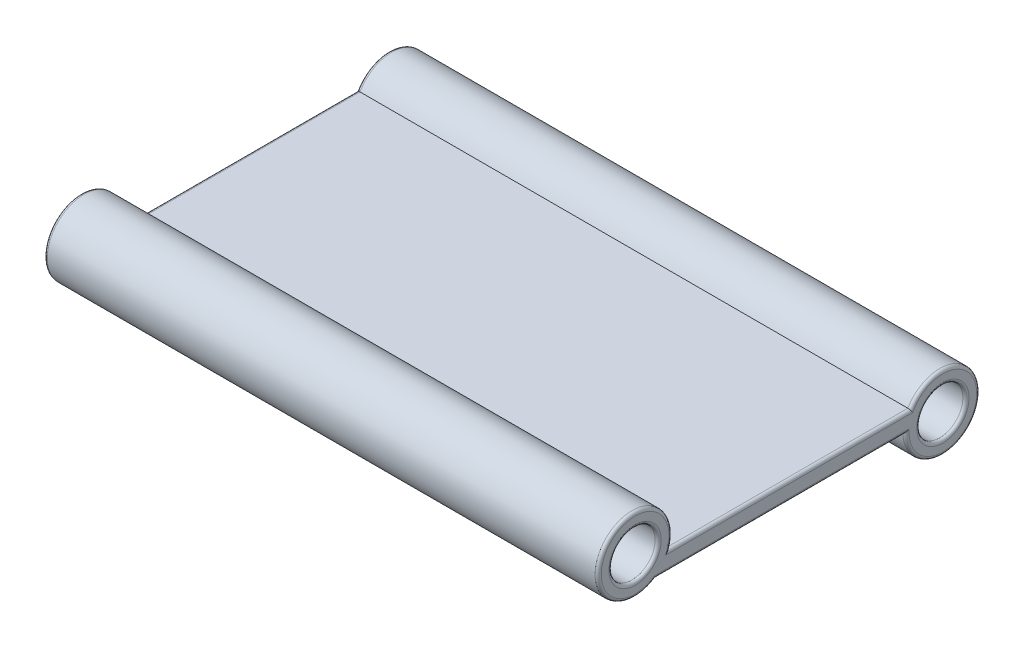
ISO-10303-21;
HEADER;
FILE_DESCRIPTION(('STEP AP214'),'2;1');
FILE_NAME('part.step','',(''),(''),'','','');
FILE_SCHEMA(('AUTOMOTIVE_DESIGN { 1 0 10303 214 1 1 1 1 }'));
ENDSEC;
DATA;
#1=APPLICATION_CONTEXT('core data for automotive mechanical design processes');
#2=APPLICATION_PROTOCOL_DEFINITION('international standard','automotive_design',2000,#1);
#3=PRODUCT_CONTEXT('',#1,'mechanical');
#4=PRODUCT('Part','Part','',(#3));
#5=PRODUCT_RELATED_PRODUCT_CATEGORY('part','',(#4));
#6=PRODUCT_DEFINITION_FORMATION('','',#4);
#7=PRODUCT_DEFINITION_CONTEXT('part definition',#1,'design');
#8=PRODUCT_DEFINITION('design','',#6,#7);
#9=PRODUCT_DEFINITION_SHAPE('','',#8);
#10=(LENGTH_UNIT() NAMED_UNIT(*) SI_UNIT(.MILLI.,.METRE.));
#11=(NAMED_UNIT(*) PLANE_ANGLE_UNIT() SI_UNIT($,.RADIAN.));
#12=(NAMED_UNIT(*) SI_UNIT($,.STERADIAN.) SOLID_ANGLE_UNIT());
#13=UNCERTAINTY_MEASURE_WITH_UNIT(LENGTH_MEASURE(1.E-05),#10,'distance_accuracy_value','');
#14=(GEOMETRIC_REPRESENTATION_CONTEXT(3) GLOBAL_UNCERTAINTY_ASSIGNED_CONTEXT((#13)) GLOBAL_UNIT_ASSIGNED_CONTEXT((#10,
#11,#12)) REPRESENTATION_CONTEXT('',''));
#15=CARTESIAN_POINT('',(0.,0.,0.));
#16=DIRECTION('',(0.,0.,1.));
#17=DIRECTION('',(1.,0.,0.));
#18=AXIS2_PLACEMENT_3D('',#15,#16,#17);
#19=CARTESIAN_POINT('',(-9.,1.,3.75));
#20=DIRECTION('',(1.,0.,0.));
#21=DIRECTION('',(0.,0.,-1.));
#22=AXIS2_PLACEMENT_3D('',#19,#20,#21);
#23=CYLINDRICAL_SURFACE('',#22,0.749999999999999);
#24=CARTESIAN_POINT('',(8.90000000000001,1.,3.75));
#25=DIRECTION('',(-1.,0.,0.));
#26=DIRECTION('',(0.,0.,1.));
#27=AXIS2_PLACEMENT_3D('',#24,#25,#26);
#28=CIRCLE('',#27,0.749999999999999);
#29=CARTESIAN_POINT('',(8.90000000000001,1.,4.5));
#30=VERTEX_POINT('',#29);
#31=EDGE_CURVE('E175',#30,#30,#28,.F.);
#32=ORIENTED_EDGE('',*,*,#31,.T.);
#33=EDGE_LOOP('',(#32));
#34=FACE_BOUND('',#33,.T.);
#35=CARTESIAN_POINT('',(-8.9,1.,3.75));
#36=DIRECTION('',(1.,0.,0.));
#37=DIRECTION('',(0.,0.,-1.));
#38=AXIS2_PLACEMENT_3D('',#35,#36,#37);
#39=CIRCLE('',#38,0.749999999999999);
#40=CARTESIAN_POINT('',(-8.9,1.,3.));
#41=VERTEX_POINT('',#40);
#42=EDGE_CURVE('E172',#41,#41,#39,.F.);
#43=ORIENTED_EDGE('',*,*,#42,.T.);
#44=EDGE_LOOP('',(#43));
#45=FACE_BOUND('',#44,.T.);
#46=CARTESIAN_POINT('',(-6.,1.,3.75));
#47=DIRECTION('',(1.,0.,0.));
#48=DIRECTION('',(0.,0.,-1.));
#49=AXIS2_PLACEMENT_3D('',#46,#47,#48);
#50=CIRCLE('',#49,0.749999999999999);
#51=CARTESIAN_POINT('',(-6.,1.2842201322584,4.44405973548321));
#52=VERTEX_POINT('',#51);
#53=CARTESIAN_POINT('',(-6.,1.7257798677416,3.56094026451679));
#54=VERTEX_POINT('',#53);
#55=EDGE_CURVE('E134',#52,#54,#50,.F.);
#56=ORIENTED_EDGE('',*,*,#55,.F.);
#57=DIRECTION('',(1.,0.,0.));
#58=VECTOR('',#57,1.);
#59=CARTESIAN_POINT('',(0.,1.2842201322584,4.44405973548321));
#60=LINE('',#59,#58);
#61=CARTESIAN_POINT('',(6.,1.2842201322584,4.44405973548321));
#62=VERTEX_POINT('',#61);
#63=EDGE_CURVE('E128',#52,#62,#60,.T.);
#64=ORIENTED_EDGE('',*,*,#63,.T.);
#65=CARTESIAN_POINT('',(6.,1.,3.75));
#66=DIRECTION('',(1.,0.,0.));
#67=DIRECTION('',(0.,0.,-1.));
#68=AXIS2_PLACEMENT_3D('',#65,#66,#67);
#69=CIRCLE('',#68,0.749999999999999);
#70=CARTESIAN_POINT('',(6.,1.7257798677416,3.56094026451679));
#71=VERTEX_POINT('',#70);
#72=EDGE_CURVE('E114',#62,#71,#69,.F.);
#73=ORIENTED_EDGE('',*,*,#72,.T.);
#74=DIRECTION('',(1.,0.,0.));
#75=VECTOR('',#74,1.);
#76=CARTESIAN_POINT('',(0.,1.7257798677416,3.56094026451679));
#77=LINE('',#76,#75);
#78=EDGE_CURVE('E122',#71,#54,#77,.F.);
#79=ORIENTED_EDGE('',*,*,#78,.T.);
#80=EDGE_LOOP('',(#56,#64,#73,#79));
#81=FACE_BOUND('',#80,.T.);
#82=ADVANCED_FACE('F33',(#34,#45,#81),#23,.F.);
#83=CARTESIAN_POINT('',(-9.,0.6,-6.25));
#84=DIRECTION('',(1.,0.,0.));
#85=DIRECTION('',(0.,0.,-1.));
#86=AXIS2_PLACEMENT_3D('',#83,#84,#85);
#87=PLANE('',#86);
#88=DIRECTION('',(0.,0.,1.));
#89=VECTOR('',#88,1.);
#90=CARTESIAN_POINT('',(-9.,0.1,-6.25));
#91=LINE('',#90,#89);
#92=CARTESIAN_POINT('',(-9.,0.1,-5.15455488498967));
#93=VERTEX_POINT('',#92);
#94=CARTESIAN_POINT('',(-9.,0.1,3.1175444679663));
#95=VERTEX_POINT('',#94);
#96=EDGE_CURVE('E47',#93,#95,#91,.T.);
#97=ORIENTED_EDGE('',*,*,#96,.T.);
#98=CARTESIAN_POINT('',(-9.,1.,3.75));
#99=DIRECTION('',(1.,0.,0.));
#100=DIRECTION('',(0.,0.,-1.));
#101=AXIS2_PLACEMENT_3D('',#98,#99,#100);
#102=CIRCLE('',#101,1.1);
#103=CARTESIAN_POINT('',(-9.,0.5,2.77020410288673));
#104=VERTEX_POINT('',#103);
#105=EDGE_CURVE('E11',#95,#104,#102,.F.);
#106=ORIENTED_EDGE('',*,*,#105,.T.);
#107=DIRECTION('',(0.,0.,1.));
#108=VECTOR('',#107,1.);
#109=CARTESIAN_POINT('',(-9.,0.5,-5.21076951545867));
#110=LINE('',#109,#108);
#111=CARTESIAN_POINT('',(-9.,0.5,-5.27020410288673));
#112=VERTEX_POINT('',#111);
#113=EDGE_CURVE('E190',#104,#112,#110,.F.);
#114=ORIENTED_EDGE('',*,*,#113,.T.);
#115=CARTESIAN_POINT('',(-9.,0.,-6.25));
#116=DIRECTION('',(1.,0.,0.));
#117=DIRECTION('',(0.,0.,-1.));
#118=AXIS2_PLACEMENT_3D('',#115,#116,#117);
#119=CIRCLE('',#118,1.1);
#120=EDGE_CURVE('E58',#112,#93,#119,.F.);
#121=ORIENTED_EDGE('',*,*,#120,.T.);
#122=EDGE_LOOP('',(#97,#106,#114,#121));
#123=FACE_BOUND('',#122,.T.);
#124=CARTESIAN_POINT('',(-9.,1.,3.75));
#125=DIRECTION('',(1.,0.,0.));
#126=DIRECTION('',(0.,0.,-1.));
#127=AXIS2_PLACEMENT_3D('',#124,#125,#126);
#128=CIRCLE('',#127,0.849999999999999);
#129=CARTESIAN_POINT('',(-9.,1.,2.9));
#130=VERTEX_POINT('',#129);
#131=EDGE_CURVE('E187',#130,#130,#128,.T.);
#132=ORIENTED_EDGE('',*,*,#131,.T.);
#133=EDGE_LOOP('',(#132));
#134=FACE_BOUND('',#133,.T.);
#135=CARTESIAN_POINT('',(-9.,0.,-6.25));
#136=DIRECTION('',(1.,0.,0.));
#137=DIRECTION('',(0.,0.,-1.));
#138=AXIS2_PLACEMENT_3D('',#135,#136,#137);
#139=CIRCLE('',#138,0.849999999999999);
#140=CARTESIAN_POINT('',(-9.,0.,-7.1));
#141=VERTEX_POINT('',#140);
#142=EDGE_CURVE('E184',#141,#141,#139,.T.);
#143=ORIENTED_EDGE('',*,*,#142,.T.);
#144=EDGE_LOOP('',(#143));
#145=FACE_BOUND('',#144,.T.);
#146=ADVANCED_FACE('F279',(#123,#134,#145),#87,.F.);
#147=CARTESIAN_POINT('',(9.,0.6,-6.25));
#148=DIRECTION('',(-1.,0.,0.));
#149=DIRECTION('',(0.,0.,1.));
#150=AXIS2_PLACEMENT_3D('',#147,#148,#149);
#151=PLANE('',#150);
#152=DIRECTION('',(0.,0.,-1.));
#153=VECTOR('',#152,1.);
#154=CARTESIAN_POINT('',(9.,0.5,2.61862915010152));
#155=LINE('',#154,#153);
#156=CARTESIAN_POINT('',(9.,0.499999999999996,-5.27020410288673));
#157=VERTEX_POINT('',#156);
#158=CARTESIAN_POINT('',(9.,0.5,2.77020410288673));
#159=VERTEX_POINT('',#158);
#160=EDGE_CURVE('E149',#157,#159,#155,.F.);
#161=ORIENTED_EDGE('',*,*,#160,.T.);
#162=CARTESIAN_POINT('',(9.,1.,3.75));
#163=DIRECTION('',(-1.,0.,0.));
#164=DIRECTION('',(0.,0.,1.));
#165=AXIS2_PLACEMENT_3D('',#162,#163,#164);
#166=CIRCLE('',#165,1.1);
#167=CARTESIAN_POINT('',(9.,0.1,3.1175444679663));
#168=VERTEX_POINT('',#167);
#169=EDGE_CURVE('E151',#159,#168,#166,.F.);
#170=ORIENTED_EDGE('',*,*,#169,.T.);
#171=DIRECTION('',(0.,0.,-1.));
#172=VECTOR('',#171,1.);
#173=CARTESIAN_POINT('',(9.,0.1,-6.25));
#174=LINE('',#173,#172);
#175=CARTESIAN_POINT('',(9.,0.1,-5.15455488498967));
#176=VERTEX_POINT('',#175);
#177=EDGE_CURVE('E145',#168,#176,#174,.T.);
#178=ORIENTED_EDGE('',*,*,#177,.T.);
#179=CARTESIAN_POINT('',(9.,0.,-6.25));
#180=DIRECTION('',(-1.,0.,0.));
#181=DIRECTION('',(0.,0.,1.));
#182=AXIS2_PLACEMENT_3D('',#179,#180,#181);
#183=CIRCLE('',#182,1.1);
#184=EDGE_CURVE('E147',#176,#157,#183,.F.);
#185=ORIENTED_EDGE('',*,*,#184,.T.);
#186=EDGE_LOOP('',(#161,#170,#178,#185));
#187=FACE_BOUND('',#186,.T.);
#188=CARTESIAN_POINT('',(9.,1.,3.75));
#189=DIRECTION('',(-1.,0.,0.));
#190=DIRECTION('',(0.,0.,1.));
#191=AXIS2_PLACEMENT_3D('',#188,#189,#190);
#192=CIRCLE('',#191,0.849999999999999);
#193=CARTESIAN_POINT('',(9.,1.,4.6));
#194=VERTEX_POINT('',#193);
#195=EDGE_CURVE('E142',#194,#194,#192,.T.);
#196=ORIENTED_EDGE('',*,*,#195,.T.);
#197=EDGE_LOOP('',(#196));
#198=FACE_BOUND('',#197,.T.);
#199=CARTESIAN_POINT('',(9.,0.,-6.25));
#200=DIRECTION('',(-1.,0.,0.));
#201=DIRECTION('',(0.,0.,1.));
#202=AXIS2_PLACEMENT_3D('',#199,#200,#201);
#203=CIRCLE('',#202,0.849999999999999);
#204=CARTESIAN_POINT('',(9.,0.,-5.4));
#205=VERTEX_POINT('',#204);
#206=EDGE_CURVE('E136',#205,#205,#203,.T.);
#207=ORIENTED_EDGE('',*,*,#206,.T.);
#208=EDGE_LOOP('',(#207));
#209=FACE_BOUND('',#208,.T.);
#210=ADVANCED_FACE('F285',(#187,#198,#209),#151,.F.);
#211=CARTESIAN_POINT('',(0.,0.6,0.));
#212=DIRECTION('',(0.,1.,0.));
#213=DIRECTION('',(0.,0.,1.));
#214=AXIS2_PLACEMENT_3D('',#211,#212,#213);
#215=PLANE('',#214);
#216=DIRECTION('',(1.,0.,0.));
#217=VECTOR('',#216,1.);
#218=CARTESIAN_POINT('',(-9.,0.6,2.61862915010153));
#219=LINE('',#218,#217);
#220=CARTESIAN_POINT('',(8.9,0.6,2.61862915010152));
#221=VERTEX_POINT('',#220);
#222=CARTESIAN_POINT('',(-8.9,0.6,2.61862915010153));
#223=VERTEX_POINT('',#222);
#224=EDGE_CURVE('E363',#221,#223,#219,.F.);
#225=ORIENTED_EDGE('',*,*,#224,.F.);
#226=DIRECTION('',(0.,0.,-1.));
#227=VECTOR('',#226,1.);
#228=CARTESIAN_POINT('',(8.9,0.6,-5.21076951545868));
#229=LINE('',#228,#227);
#230=CARTESIAN_POINT('',(8.9,0.6,-5.21076951545868));
#231=VERTEX_POINT('',#230);
#232=EDGE_CURVE('E162',#221,#231,#229,.T.);
#233=ORIENTED_EDGE('',*,*,#232,.T.);
#234=DIRECTION('',(1.,0.,0.));
#235=VECTOR('',#234,1.);
#236=CARTESIAN_POINT('',(-9.,0.6,-5.21076951545867));
#237=LINE('',#236,#235);
#238=CARTESIAN_POINT('',(-8.9,0.6,-5.21076951545867));
#239=VERTEX_POINT('',#238);
#240=EDGE_CURVE('E369',#239,#231,#237,.T.);
#241=ORIENTED_EDGE('',*,*,#240,.F.);
#242=DIRECTION('',(0.,0.,1.));
#243=VECTOR('',#242,1.);
#244=CARTESIAN_POINT('',(-8.9,0.6,2.61862915010153));
#245=LINE('',#244,#243);
#246=EDGE_CURVE('E160',#239,#223,#245,.T.);
#247=ORIENTED_EDGE('',*,*,#246,.T.);
#248=EDGE_LOOP('',(#225,#233,#241,#247));
#249=FACE_BOUND('',#248,.T.);
#250=ADVANCED_FACE('F300',(#249),#215,.T.);
#251=CARTESIAN_POINT('',(0.,0.,0.));
#252=DIRECTION('',(0.,1.,0.));
#253=DIRECTION('',(0.,0.,1.));
#254=AXIS2_PLACEMENT_3D('',#251,#252,#253);
#255=PLANE('',#254);
#256=DIRECTION('',(1.,0.,0.));
#257=VECTOR('',#256,1.);
#258=CARTESIAN_POINT('',(-9.,0.,-5.05));
#259=LINE('',#258,#257);
#260=CARTESIAN_POINT('',(-8.9,0.,-5.05));
#261=VERTEX_POINT('',#260);
#262=CARTESIAN_POINT('',(8.9,0.,-5.05));
#263=VERTEX_POINT('',#262);
#264=EDGE_CURVE('E123',#261,#263,#259,.T.);
#265=ORIENTED_EDGE('',*,*,#264,.T.);
#266=DIRECTION('',(0.,0.,-1.));
#267=VECTOR('',#266,1.);
#268=CARTESIAN_POINT('',(8.9,0.,0.));
#269=LINE('',#268,#267);
#270=CARTESIAN_POINT('',(8.9,0.,3.08667504192892));
#271=VERTEX_POINT('',#270);
#272=EDGE_CURVE('E170',#263,#271,#269,.F.);
#273=ORIENTED_EDGE('',*,*,#272,.T.);
#274=DIRECTION('',(1.,0.,0.));
#275=VECTOR('',#274,1.);
#276=CARTESIAN_POINT('',(-9.,0.,3.08667504192892));
#277=LINE('',#276,#275);
#278=CARTESIAN_POINT('',(-8.9,0.,3.08667504192892));
#279=VERTEX_POINT('',#278);
#280=EDGE_CURVE('E357',#271,#279,#277,.F.);
#281=ORIENTED_EDGE('',*,*,#280,.T.);
#282=DIRECTION('',(0.,0.,1.));
#283=VECTOR('',#282,1.);
#284=CARTESIAN_POINT('',(-8.9,0.,0.));
#285=LINE('',#284,#283);
#286=EDGE_CURVE('E168',#279,#261,#285,.F.);
#287=ORIENTED_EDGE('',*,*,#286,.T.);
#288=EDGE_LOOP('',(#265,#273,#281,#287));
#289=FACE_BOUND('',#288,.T.);
#290=ADVANCED_FACE('F298',(#289),#255,.F.);
#291=CARTESIAN_POINT('',(-9.,1.,3.75));
#292=DIRECTION('',(1.,0.,0.));
#293=DIRECTION('',(0.,0.,-1.));
#294=AXIS2_PLACEMENT_3D('',#291,#292,#293);
#295=CYLINDRICAL_SURFACE('',#294,1.2);
#296=ORIENTED_EDGE('',*,*,#280,.F.);
#297=CARTESIAN_POINT('',(8.90000000000001,1.,3.75));
#298=DIRECTION('',(-1.,0.,0.));
#299=DIRECTION('',(0.,0.,1.));
#300=AXIS2_PLACEMENT_3D('',#297,#298,#299);
#301=CIRCLE('',#300,1.2);
#302=EDGE_CURVE('E157',#271,#221,#301,.T.);
#303=ORIENTED_EDGE('',*,*,#302,.T.);
#304=ORIENTED_EDGE('',*,*,#224,.T.);
#305=CARTESIAN_POINT('',(-8.9,1.,3.75));
#306=DIRECTION('',(1.,0.,0.));
#307=DIRECTION('',(0.,0.,-1.));
#308=AXIS2_PLACEMENT_3D('',#305,#306,#307);
#309=CIRCLE('',#308,1.2);
#310=EDGE_CURVE('E154',#223,#279,#309,.T.);
#311=ORIENTED_EDGE('',*,*,#310,.T.);
#312=EDGE_LOOP('',(#296,#303,#304,#311));
#313=FACE_BOUND('',#312,.T.);
#314=ADVANCED_FACE('F294',(#313),#295,.T.);
#315=CARTESIAN_POINT('',(-9.,0.,-6.25));
#316=DIRECTION('',(1.,0.,0.));
#317=DIRECTION('',(0.,0.,-1.));
#318=AXIS2_PLACEMENT_3D('',#315,#316,#317);
#319=CYLINDRICAL_SURFACE('',#318,1.2);
#320=ORIENTED_EDGE('',*,*,#240,.T.);
#321=CARTESIAN_POINT('',(8.9,0.,-6.25));
#322=DIRECTION('',(-1.,0.,0.));
#323=DIRECTION('',(0.,0.,1.));
#324=AXIS2_PLACEMENT_3D('',#321,#322,#323);
#325=CIRCLE('',#324,1.2);
#326=EDGE_CURVE('E166',#231,#263,#325,.T.);
#327=ORIENTED_EDGE('',*,*,#326,.T.);
#328=ORIENTED_EDGE('',*,*,#264,.F.);
#329=CARTESIAN_POINT('',(-8.9,0.,-6.25));
#330=DIRECTION('',(1.,0.,0.));
#331=DIRECTION('',(0.,0.,-1.));
#332=AXIS2_PLACEMENT_3D('',#329,#330,#331);
#333=CIRCLE('',#332,1.2);
#334=EDGE_CURVE('E164',#261,#239,#333,.T.);
#335=ORIENTED_EDGE('',*,*,#334,.T.);
#336=EDGE_LOOP('',(#320,#327,#328,#335));
#337=FACE_BOUND('',#336,.T.);
#338=ADVANCED_FACE('F291',(#337),#319,.T.);
#339=CARTESIAN_POINT('',(-9.,0.,-6.25));
#340=DIRECTION('',(1.,0.,0.));
#341=DIRECTION('',(0.,0.,-1.));
#342=AXIS2_PLACEMENT_3D('',#339,#340,#341);
#343=CYLINDRICAL_SURFACE('',#342,0.749999999999998);
#344=CARTESIAN_POINT('',(8.9,0.,-6.25));
#345=DIRECTION('',(-1.,0.,0.));
#346=DIRECTION('',(0.,0.,1.));
#347=AXIS2_PLACEMENT_3D('',#344,#345,#346);
#348=CIRCLE('',#347,0.749999999999998);
#349=CARTESIAN_POINT('',(8.9,0.,-5.5));
#350=VERTEX_POINT('',#349);
#351=EDGE_CURVE('E181',#350,#350,#348,.F.);
#352=ORIENTED_EDGE('',*,*,#351,.T.);
#353=EDGE_LOOP('',(#352));
#354=FACE_BOUND('',#353,.T.);
#355=CARTESIAN_POINT('',(-8.9,0.,-6.25));
#356=DIRECTION('',(1.,0.,0.));
#357=DIRECTION('',(0.,0.,-1.));
#358=AXIS2_PLACEMENT_3D('',#355,#356,#357);
#359=CIRCLE('',#358,0.749999999999998);
#360=CARTESIAN_POINT('',(-8.9,0.,-7.));
#361=VERTEX_POINT('',#360);
#362=EDGE_CURVE('E178',#361,#361,#359,.F.);
#363=ORIENTED_EDGE('',*,*,#362,.T.);
#364=EDGE_LOOP('',(#363));
#365=FACE_BOUND('',#364,.T.);
#366=ADVANCED_FACE('F289',(#354,#365),#343,.F.);
#367=CARTESIAN_POINT('',(-6.,1.2,3.85));
#368=DIRECTION('',(1.,0.,0.));
#369=DIRECTION('',(0.,0.,-1.));
#370=AXIS2_PLACEMENT_3D('',#367,#368,#369);
#371=CYLINDRICAL_SURFACE('',#370,0.6);
#372=CARTESIAN_POINT('',(-6.,1.2,3.85));
#373=DIRECTION('',(1.,0.,0.));
#374=DIRECTION('',(0.,0.,-1.));
#375=AXIS2_PLACEMENT_3D('',#372,#373,#374);
#376=CIRCLE('',#375,0.6);
#377=EDGE_CURVE('E130',#54,#52,#376,.T.);
#378=ORIENTED_EDGE('',*,*,#377,.F.);
#379=ORIENTED_EDGE('',*,*,#78,.F.);
#380=CARTESIAN_POINT('',(6.,1.2,3.85));
#381=DIRECTION('',(1.,0.,0.));
#382=DIRECTION('',(0.,0.,-1.));
#383=AXIS2_PLACEMENT_3D('',#380,#381,#382);
#384=CIRCLE('',#383,0.6);
#385=EDGE_CURVE('E117',#71,#62,#384,.T.);
#386=ORIENTED_EDGE('',*,*,#385,.T.);
#387=ORIENTED_EDGE('',*,*,#63,.F.);
#388=EDGE_LOOP('',(#378,#379,#386,#387));
#389=FACE_BOUND('',#388,.T.);
#390=ADVANCED_FACE('F127',(#389),#371,.F.);
#391=CARTESIAN_POINT('',(-6.,1.2,3.85));
#392=DIRECTION('',(1.,0.,0.));
#393=DIRECTION('',(0.,0.,-1.));
#394=AXIS2_PLACEMENT_3D('',#391,#392,#393);
#395=PLANE('',#394);
#396=ORIENTED_EDGE('',*,*,#55,.T.);
#397=ORIENTED_EDGE('',*,*,#377,.T.);
#398=EDGE_LOOP('',(#396,#397));
#399=FACE_BOUND('',#398,.T.);
#400=ADVANCED_FACE('F331',(#399),#395,.T.);
#401=CARTESIAN_POINT('',(6.,1.2,3.85));
#402=DIRECTION('',(1.,0.,0.));
#403=DIRECTION('',(0.,0.,-1.));
#404=AXIS2_PLACEMENT_3D('',#401,#402,#403);
#405=PLANE('',#404);
#406=ORIENTED_EDGE('',*,*,#385,.F.);
#407=ORIENTED_EDGE('',*,*,#72,.F.);
#408=EDGE_LOOP('',(#406,#407));
#409=FACE_BOUND('',#408,.T.);
#410=ADVANCED_FACE('F116',(#409),#405,.F.);
#411=CARTESIAN_POINT('',(8.9,0.,-6.25));
#412=DIRECTION('',(-1.,0.,0.));
#413=DIRECTION('',(0.,0.,1.));
#414=AXIS2_PLACEMENT_3D('',#411,#412,#413);
#415=TOROIDAL_SURFACE('',#414,1.1,0.1);
#416=CARTESIAN_POINT('',(8.9,0.,-5.05));
#417=CARTESIAN_POINT('',(8.90447280182159,-7.56789666817953E-06,-5.04999281799082));
#418=CARTESIAN_POINT('',(8.90893472272075,0.000299563193221933,-5.05029955268923));
#419=CARTESIAN_POINT('',(8.91766945780604,0.0014777687668382,-5.05147843812991));
#420=CARTESIAN_POINT('',(8.92194355171334,0.00234405418794809,-5.05234578738932));
#421=CARTESIAN_POINT('',(8.93020454331359,0.00457416123096601,-5.05458242796648));
#422=CARTESIAN_POINT('',(8.93419215730438,0.00593668628127007,-5.05595041127549));
#423=CARTESIAN_POINT('',(8.94182893044247,0.0090746807129433,-5.05910819759843));
#424=CARTESIAN_POINT('',(8.94547733328299,0.010851043293806,-5.0608989131224));
#425=CARTESIAN_POINT('',(8.95377128440094,0.0155050470549084,-5.06560338596101));
#426=CARTESIAN_POINT('',(8.95823596617532,0.0185396455231813,-5.06868048771326));
#427=CARTESIAN_POINT('',(8.96641404794379,0.0250558329755519,-5.07531830183884));
#428=CARTESIAN_POINT('',(8.97012601498885,0.0285382542751742,-5.07887991544919));
#429=CARTESIAN_POINT('',(8.9781855386476,0.0372691129437967,-5.08785481642772));
#430=CARTESIAN_POINT('',(8.98218661221143,0.0426637803411467,-5.09343599018564));
#431=CARTESIAN_POINT('',(8.9889130195872,0.0537750483617409,-5.10502243436898));
#432=CARTESIAN_POINT('',(8.99163659048656,0.0594920817316737,-5.11102827775846));
#433=CARTESIAN_POINT('',(8.99581531583967,0.0707807125314728,-5.12298613554824));
#434=CARTESIAN_POINT('',(8.99732762496759,0.0763450548406498,-5.12892552661403));
#435=CARTESIAN_POINT('',(8.99937694666484,0.0874981800065428,-5.14092818378544));
#436=CARTESIAN_POINT('',(8.99991575488136,0.0930868987656016,-5.14699120091735));
#437=CARTESIAN_POINT('',(8.99999695177518,0.0990990555063486,-5.15356828131353));
#438=CARTESIAN_POINT('',(8.99999999329533,0.0995496293520496,-5.15406152664147));
#439=CARTESIAN_POINT('',(9.,0.1,-5.15455488498967));
#440=B_SPLINE_CURVE_WITH_KNOTS('',3,(#416,#417,#418,#419,#420,#421,#422,#423,#424,#425,#426,
#427,#428,#429,#430,#431,#432,#433,#434,#435,#436,#437,#438,#439),.UNSPECIFIED.,.F.,.F.,(4,2,2,
2,2,2,2,2,2,2,2,4),(0.,0.0133801370379411,0.0266471693417634,0.039879783433004,
0.0531412269401369,0.0716793949593213,0.0902525296011135,0.116308814715605,0.142400951641103,
0.167174242174456,0.191901790911253,0.193905965555932),.UNSPECIFIED.);
#441=EDGE_CURVE('E231',#263,#176,#440,.T.);
#442=ORIENTED_EDGE('',*,*,#441,.F.);
#443=ORIENTED_EDGE('',*,*,#326,.F.);
#444=CARTESIAN_POINT('',(8.9,0.6,-5.21076951545868));
#445=CARTESIAN_POINT('',(8.90508200927497,0.60000664423092,-5.21076595123366));
#446=CARTESIAN_POINT('',(8.91015844548194,0.599613071532311,-5.21099290855104));
#447=CARTESIAN_POINT('',(8.9201372891472,0.598079042681484,-5.21187900815015));
#448=CARTESIAN_POINT('',(8.92504033913226,0.596941736975823,-5.21253632743626));
#449=CARTESIAN_POINT('',(8.93455086236981,0.593974183090198,-5.21425403332362));
#450=CARTESIAN_POINT('',(8.93915856988233,0.592144492253724,-5.21531409573482));
#451=CARTESIAN_POINT('',(8.94797939362872,0.587874882610124,-5.21779294623292));
#452=CARTESIAN_POINT('',(8.952192197475,0.585434486212817,-5.21921201508325));
#453=CARTESIAN_POINT('',(8.96034119512434,0.579902424218265,-5.22243704543216));
#454=CARTESIAN_POINT('',(8.96425312702464,0.576784354960874,-5.22425876851315));
#455=CARTESIAN_POINT('',(8.97149766777319,0.570088793452493,-5.22818279368779));
#456=CARTESIAN_POINT('',(8.97483011893246,0.566511176607935,-5.23028517187937));
#457=CARTESIAN_POINT('',(8.98126926651136,0.558522236385774,-5.23499610873364));
#458=CARTESIAN_POINT('',(8.98429383154449,0.554062715715606,-5.23763505040046));
#459=CARTESIAN_POINT('',(8.98955209779765,0.544818996015191,-5.24312843344538));
#460=CARTESIAN_POINT('',(8.99178503510907,0.54003448865294,-5.24598307977086));
#461=CARTESIAN_POINT('',(8.99564660151406,0.529748601677711,-5.25214791634471));
#462=CARTESIAN_POINT('',(8.99718798446352,0.524224481030921,-5.25547457527202));
#463=CARTESIAN_POINT('',(8.99930476405611,0.513066268170587,-5.26222933227598));
#464=CARTESIAN_POINT('',(8.99988192101016,0.507432395395401,-5.2656572338483));
#465=CARTESIAN_POINT('',(8.99999456391144,0.501204857037524,-5.26946648824989));
#466=CARTESIAN_POINT('',(9.00000000735409,0.500602334781666,-5.26983524758579));
#467=CARTESIAN_POINT('',(9.,0.5,-5.27020410288673));
#468=B_SPLINE_CURVE_WITH_KNOTS('',3,(#444,#445,#446,#447,#448,#449,#450,#451,#452,#453,#454,
#455,#456,#457,#458,#459,#460,#461,#462,#463,#464,#465,#466,#467),.UNSPECIFIED.,.F.,.F.,(4,2,2,
2,2,2,2,2,2,2,2,4),(0.,0.0152170126620498,0.0303699801289568,0.0455107758952378,
0.0606634494264165,0.0765715702959483,0.0924840133505155,0.110413050424777,0.128359341951631,
0.148176187300563,0.167956814912992,0.170076012485945),.UNSPECIFIED.);
#469=EDGE_CURVE('E131',#157,#231,#468,.F.);
#470=ORIENTED_EDGE('',*,*,#469,.F.);
#471=ORIENTED_EDGE('',*,*,#184,.F.);
#472=EDGE_LOOP('',(#442,#443,#470,#471));
#473=FACE_BOUND('',#472,.T.);
#474=ADVANCED_FACE('F220',(#473),#415,.T.);
#475=CARTESIAN_POINT('',(8.9,0.5,0.));
#476=DIRECTION('',(0.,0.,1.));
#477=DIRECTION('',(1.,0.,0.));
#478=AXIS2_PLACEMENT_3D('',#475,#476,#477);
#479=CYLINDRICAL_SURFACE('',#478,0.1);
#480=ORIENTED_EDGE('',*,*,#469,.T.);
#481=ORIENTED_EDGE('',*,*,#232,.F.);
#482=CARTESIAN_POINT('',(8.9,0.6,2.61862915010152));
#483=CARTESIAN_POINT('',(8.9040208829211,0.600007855864887,2.61861851931358));
#484=CARTESIAN_POINT('',(8.90802456693186,0.599758014599713,2.6189713398626));
#485=CARTESIAN_POINT('',(8.91582146501583,0.598815348330459,2.6203054310626));
#486=CARTESIAN_POINT('',(8.9196167077198,0.598128195371936,2.62127865518482));
#487=CARTESIAN_POINT('',(8.92691143648807,0.596384350332579,2.6237534307154));
#488=CARTESIAN_POINT('',(8.93041227104886,0.595329471548711,2.62525238988422));
#489=CARTESIAN_POINT('',(8.93710422460215,0.59292971929608,2.62867129300058));
#490=CARTESIAN_POINT('',(8.94029424304862,0.591583866068826,2.6305926596411));
#491=CARTESIAN_POINT('',(8.94803500054796,0.587863900223102,2.63591971799268));
#492=CARTESIAN_POINT('',(8.95235199834481,0.585335018812181,2.63955548875687));
#493=CARTESIAN_POINT('',(8.96025403318039,0.579952252250152,2.64733842784122));
#494=CARTESIAN_POINT('',(8.96383742104095,0.577097656822074,2.65148671548999));
#495=CARTESIAN_POINT('',(8.97255366983116,0.569211352530651,2.66301891016538));
#496=CARTESIAN_POINT('',(8.97711695877856,0.56400196787056,2.67070913279916));
#497=CARTESIAN_POINT('',(8.98483223441117,0.553354149743723,2.68661050003425));
#498=CARTESIAN_POINT('',(8.98798087188687,0.547915205717795,2.69482282885287));
#499=CARTESIAN_POINT('',(8.99377964926158,0.535544996356147,2.71373032395897));
#500=CARTESIAN_POINT('',(8.99608720610541,0.528593478790507,2.72451576925786));
#501=CARTESIAN_POINT('',(8.99915564936267,0.514768115888698,2.74631834120344));
#502=CARTESIAN_POINT('',(8.99991892861918,0.507894166823399,2.75733508265156));
#503=CARTESIAN_POINT('',(8.99999794685916,0.500738021050464,2.76899947225528));
#504=CARTESIAN_POINT('',(8.99999998651185,0.500368877005606,2.76960172644861));
#505=CARTESIAN_POINT('',(9.,0.5,2.77020410288673));
#506=B_SPLINE_CURVE_WITH_KNOTS('',3,(#482,#483,#484,#485,#486,#487,#488,#489,#490,#491,#492,
#493,#494,#495,#496,#497,#498,#499,#500,#501,#502,#503,#504,#505),.UNSPECIFIED.,.F.,.F.,(4,2,2,
2,2,2,2,2,2,2,2,4),(0.,0.0120122417301326,0.023871771460964,0.0356736289955743,
0.0475158620275875,0.0659648033642658,0.084454773790768,0.115328111630256,0.146274162312244,
0.18526800864743,0.224201387981045,0.226320531593968),.UNSPECIFIED.);
#507=EDGE_CURVE('E201',#159,#221,#506,.F.);
#508=ORIENTED_EDGE('',*,*,#507,.F.);
#509=ORIENTED_EDGE('',*,*,#160,.F.);
#510=EDGE_LOOP('',(#480,#481,#508,#509));
#511=FACE_BOUND('',#510,.T.);
#512=ADVANCED_FACE('F215',(#511),#479,.T.);
#513=CARTESIAN_POINT('',(8.9,0.1,-6.25));
#514=DIRECTION('',(0.,0.,-1.));
#515=DIRECTION('',(-1.,0.,0.));
#516=AXIS2_PLACEMENT_3D('',#513,#514,#515);
#517=CYLINDRICAL_SURFACE('',#516,0.1);
#518=ORIENTED_EDGE('',*,*,#441,.T.);
#519=ORIENTED_EDGE('',*,*,#177,.F.);
#520=CARTESIAN_POINT('',(8.9,0.,3.08667504192892));
#521=CARTESIAN_POINT('',(8.9054507372964,-5.51449421425006E-06,3.08667354048844));
#522=CARTESIAN_POINT('',(8.91089869987686,0.000445292637679222,3.08680930476421));
#523=CARTESIAN_POINT('',(8.92162779749864,0.00221736115196796,3.08734384237588));
#524=CARTESIAN_POINT('',(8.92690922658046,0.00353698651306095,3.08774212138707));
#525=CARTESIAN_POINT('',(8.93716597600453,0.00700492200770313,3.08879028430596));
#526=CARTESIAN_POINT('',(8.94214127279578,0.00915329580532808,3.08944018754333));
#527=CARTESIAN_POINT('',(8.95165348583689,0.0142042878510148,3.09097126554107));
#528=CARTESIAN_POINT('',(8.95619036240592,0.0171069742833838,3.09185246120865));
#529=CARTESIAN_POINT('',(8.96478801159991,0.0236314732645393,3.09383812235879));
#530=CARTESIAN_POINT('',(8.96883902311228,0.0272650203284672,3.09494623727366));
#531=CARTESIAN_POINT('',(8.97627689069403,0.03510732413222,3.09734503199519));
#532=CARTESIAN_POINT('',(8.97966349487007,0.0393162980084182,3.09863578072488));
#533=CARTESIAN_POINT('',(8.98582232587524,0.0483694498988453,3.10142137261163));
#534=CARTESIAN_POINT('',(8.98856400177726,0.0532324874962654,3.10292237715827));
#535=CARTESIAN_POINT('',(8.99319195141373,0.0633122940097073,3.10604540992176));
#536=CARTESIAN_POINT('',(8.99507848987762,0.0685289528776371,3.107667400503));
#537=CARTESIAN_POINT('',(8.99756761416146,0.0777148437722488,3.11053496958612));
#538=CARTESIAN_POINT('',(8.99838030079286,0.0816346645310567,3.11176205225931));
#539=CARTESIAN_POINT('',(8.99953021295155,0.0895308305708489,3.11424124290287));
#540=CARTESIAN_POINT('',(8.99986819937484,0.0935070750507702,3.11549330755433));
#541=CARTESIAN_POINT('',(8.99998947952048,0.0983233447530731,3.11701442876565));
#542=CARTESIAN_POINT('',(9.00000002740239,0.0991617741184837,3.11727939632854));
#543=CARTESIAN_POINT('',(9.,0.1,3.11754446796633));
#544=B_SPLINE_CURVE_WITH_KNOTS('',3,(#520,#521,#522,#523,#524,#525,#526,#527,#528,#529,#530,
#531,#532,#533,#534,#535,#536,#537,#538,#539,#540,#541,#542,#543),.UNSPECIFIED.,.F.,.F.,(4,2,2,
2,2,2,2,2,2,2,2,4),(0.,0.016327686105238,0.0326247140902068,0.0489229942547999,
0.0652227481766609,0.0818087710537241,0.0984010700038207,0.115667480110153,0.132928541305552,
0.145464785742469,0.157980912836089,0.160618717154829),.UNSPECIFIED.);
#545=EDGE_CURVE('E194',#271,#168,#544,.T.);
#546=ORIENTED_EDGE('',*,*,#545,.F.);
#547=ORIENTED_EDGE('',*,*,#272,.F.);
#548=EDGE_LOOP('',(#518,#519,#546,#547));
#549=FACE_BOUND('',#548,.T.);
#550=ADVANCED_FACE('F207',(#549),#517,.T.);
#551=CARTESIAN_POINT('',(8.90000000000001,1.,3.75));
#552=DIRECTION('',(-1.,0.,0.));
#553=DIRECTION('',(0.,0.,1.));
#554=AXIS2_PLACEMENT_3D('',#551,#552,#553);
#555=TOROIDAL_SURFACE('',#554,1.1,0.1);
#556=ORIENTED_EDGE('',*,*,#507,.T.);
#557=ORIENTED_EDGE('',*,*,#302,.F.);
#558=ORIENTED_EDGE('',*,*,#545,.T.);
#559=ORIENTED_EDGE('',*,*,#169,.F.);
#560=EDGE_LOOP('',(#556,#557,#558,#559));
#561=FACE_BOUND('',#560,.T.);
#562=ADVANCED_FACE('F210',(#561),#555,.T.);
#563=CARTESIAN_POINT('',(8.90000000000001,1.,3.75));
#564=DIRECTION('',(-1.,0.,0.));
#565=DIRECTION('',(0.,0.,1.));
#566=AXIS2_PLACEMENT_3D('',#563,#564,#565);
#567=TOROIDAL_SURFACE('',#566,0.849999999999999,0.1);
#568=ORIENTED_EDGE('',*,*,#195,.F.);
#569=EDGE_LOOP('',(#568));
#570=FACE_BOUND('',#569,.T.);
#571=ORIENTED_EDGE('',*,*,#31,.F.);
#572=EDGE_LOOP('',(#571));
#573=FACE_BOUND('',#572,.T.);
#574=ADVANCED_FACE('F213',(#570,#573),#567,.T.);
#575=CARTESIAN_POINT('',(8.9,0.,-6.25));
#576=DIRECTION('',(-1.,0.,0.));
#577=DIRECTION('',(0.,0.,1.));
#578=AXIS2_PLACEMENT_3D('',#575,#576,#577);
#579=TOROIDAL_SURFACE('',#578,0.849999999999999,0.1);
#580=ORIENTED_EDGE('',*,*,#206,.F.);
#581=EDGE_LOOP('',(#580));
#582=FACE_BOUND('',#581,.T.);
#583=ORIENTED_EDGE('',*,*,#351,.F.);
#584=EDGE_LOOP('',(#583));
#585=FACE_BOUND('',#584,.T.);
#586=ADVANCED_FACE('F264',(#582,#585),#579,.T.);
#587=CARTESIAN_POINT('',(-8.9,0.,-6.25));
#588=DIRECTION('',(1.,0.,0.));
#589=DIRECTION('',(0.,0.,-1.));
#590=AXIS2_PLACEMENT_3D('',#587,#588,#589);
#591=TOROIDAL_SURFACE('',#590,1.1,0.1);
#592=CARTESIAN_POINT('',(-8.9,0.,-5.05));
#593=CARTESIAN_POINT('',(-8.90447280182158,-7.5678966683444E-06,-5.04999281799082));
#594=CARTESIAN_POINT('',(-8.90893472272075,0.00029956319322161,-5.05029955268923));
#595=CARTESIAN_POINT('',(-8.91766945780604,0.00147776876683758,-5.05147843812991));
#596=CARTESIAN_POINT('',(-8.92194355171333,0.00234405418794733,-5.05234578738932));
#597=CARTESIAN_POINT('',(-8.93020454331358,0.0045741612309647,-5.05458242796647));
#598=CARTESIAN_POINT('',(-8.93419215730437,0.00593668628126821,-5.05595041127549));
#599=CARTESIAN_POINT('',(-8.94182893044247,0.00907468071294089,-5.05910819759843));
#600=CARTESIAN_POINT('',(-8.94547733328298,0.0108510432938039,-5.06089891312239));
#601=CARTESIAN_POINT('',(-8.95377128440093,0.0155050470549066,-5.06560338596101));
#602=CARTESIAN_POINT('',(-8.95823596617532,0.0185396455231796,-5.06868048771326));
#603=CARTESIAN_POINT('',(-8.96641404794379,0.0250558329755496,-5.07531830183884));
#604=CARTESIAN_POINT('',(-8.97012601498885,0.028538254275171,-5.07887991544919));
#605=CARTESIAN_POINT('',(-8.9781855386476,0.0372691129437957,-5.08785481642772));
#606=CARTESIAN_POINT('',(-8.98218661221143,0.0426637803411505,-5.09343599018564));
#607=CARTESIAN_POINT('',(-8.9889130195872,0.0537750483617327,-5.10502243436898));
#608=CARTESIAN_POINT('',(-8.99163659048656,0.0594920817316486,-5.11102827775848));
#609=CARTESIAN_POINT('',(-8.99581531583967,0.0707807125314897,-5.12298613554822));
#610=CARTESIAN_POINT('',(-8.99732762496758,0.0763450548407219,-5.12892552661395));
#611=CARTESIAN_POINT('',(-8.99937694666484,0.0874981800064592,-5.14092818378551));
#612=CARTESIAN_POINT('',(-8.99991575488137,0.0930868987653076,-5.14699120091761));
#613=CARTESIAN_POINT('',(-8.99999695177518,0.0990990555063025,-5.15356828131356));
#614=CARTESIAN_POINT('',(-8.99999999329533,0.0995496293520249,-5.15406152664149));
#615=CARTESIAN_POINT('',(-9.,0.1,-5.15455488498967));
#616=B_SPLINE_CURVE_WITH_KNOTS('',3,(#592,#593,#594,#595,#596,#597,#598,#599,#600,#601,#602,
#603,#604,#605,#606,#607,#608,#609,#610,#611,#612,#613,#614,#615),.UNSPECIFIED.,.F.,.F.,(4,2,2,
2,2,2,2,2,2,2,2,4),(0.,0.0133801370379411,0.0266471693417631,0.0398797834329999,
0.0531412269401363,0.071679394959321,0.0902525296011141,0.116308814715607,0.142400951641104,
0.167174242174456,0.191901790911255,0.193905965555934),.UNSPECIFIED.);
#617=EDGE_CURVE('E256',#93,#261,#616,.F.);
#618=ORIENTED_EDGE('',*,*,#617,.F.);
#619=ORIENTED_EDGE('',*,*,#120,.F.);
#620=CARTESIAN_POINT('',(-8.9,0.6,-5.21076951545867));
#621=CARTESIAN_POINT('',(-8.90508200927497,0.60000664423092,-5.21076595123366));
#622=CARTESIAN_POINT('',(-8.91015844548194,0.599613071532311,-5.21099290855104));
#623=CARTESIAN_POINT('',(-8.92013728914719,0.598079042681485,-5.21187900815015));
#624=CARTESIAN_POINT('',(-8.92504033913225,0.596941736975824,-5.21253632743626));
#625=CARTESIAN_POINT('',(-8.93455086236981,0.593974183090199,-5.21425403332362));
#626=CARTESIAN_POINT('',(-8.93915856988232,0.592144492253725,-5.21531409573482));
#627=CARTESIAN_POINT('',(-8.94797939362872,0.587874882610125,-5.21779294623292));
#628=CARTESIAN_POINT('',(-8.95219219747499,0.585434486212818,-5.21921201508325));
#629=CARTESIAN_POINT('',(-8.96034119512434,0.579902424218267,-5.22243704543216));
#630=CARTESIAN_POINT('',(-8.96425312702464,0.576784354960876,-5.22425876851315));
#631=CARTESIAN_POINT('',(-8.97149766777319,0.570088793452496,-5.22818279368778));
#632=CARTESIAN_POINT('',(-8.97483011893246,0.566511176607938,-5.23028517187936));
#633=CARTESIAN_POINT('',(-8.98126926651136,0.558522236385776,-5.23499610873364));
#634=CARTESIAN_POINT('',(-8.98429383154449,0.554062715715607,-5.23763505040046));
#635=CARTESIAN_POINT('',(-8.98955209779764,0.544818996015195,-5.24312843344538));
#636=CARTESIAN_POINT('',(-8.99178503510907,0.540034488652949,-5.24598307977087));
#637=CARTESIAN_POINT('',(-8.99564660151406,0.529748601677707,-5.2521479163447));
#638=CARTESIAN_POINT('',(-8.99718798446352,0.524224481030898,-5.25547457527197));
#639=CARTESIAN_POINT('',(-8.9993047640561,0.513066268170618,-5.26222933227602));
#640=CARTESIAN_POINT('',(-8.99988192101016,0.507432395395505,-5.26565723384847));
#641=CARTESIAN_POINT('',(-8.99999456391143,0.501204857037546,-5.26946648824992));
#642=CARTESIAN_POINT('',(-9.00000000735409,0.500602334781678,-5.26983524758581));
#643=CARTESIAN_POINT('',(-9.,0.5,-5.27020410288673));
#644=B_SPLINE_CURVE_WITH_KNOTS('',3,(#620,#621,#622,#623,#624,#625,#626,#627,#628,#629,#630,
#631,#632,#633,#634,#635,#636,#637,#638,#639,#640,#641,#642,#643),.UNSPECIFIED.,.F.,.F.,(4,2,2,
2,2,2,2,2,2,2,2,4),(0.,0.0152170126620481,0.0303699801289565,0.0455107758952377,
0.0606634494264158,0.0765715702959472,0.092484013350514,0.110413050424776,0.12835934195163,
0.148176187300564,0.167956814912994,0.170076012485947),.UNSPECIFIED.);
#645=EDGE_CURVE('E37',#239,#112,#644,.T.);
#646=ORIENTED_EDGE('',*,*,#645,.F.);
#647=ORIENTED_EDGE('',*,*,#334,.F.);
#648=EDGE_LOOP('',(#618,#619,#646,#647));
#649=FACE_BOUND('',#648,.T.);
#650=ADVANCED_FACE('F261',(#649),#591,.T.);
#651=CARTESIAN_POINT('',(-8.9,0.5,0.));
#652=DIRECTION('',(0.,0.,-1.));
#653=DIRECTION('',(-1.,0.,0.));
#654=AXIS2_PLACEMENT_3D('',#651,#652,#653);
#655=CYLINDRICAL_SURFACE('',#654,0.1);
#656=ORIENTED_EDGE('',*,*,#645,.T.);
#657=ORIENTED_EDGE('',*,*,#113,.F.);
#658=CARTESIAN_POINT('',(-8.9,0.6,2.61862915010153));
#659=CARTESIAN_POINT('',(-8.9040208829211,0.600007855864887,2.61861851931358));
#660=CARTESIAN_POINT('',(-8.90802456693186,0.599758014599713,2.6189713398626));
#661=CARTESIAN_POINT('',(-8.91582146501582,0.598815348330459,2.62030543106261));
#662=CARTESIAN_POINT('',(-8.9196167077198,0.598128195371937,2.62127865518482));
#663=CARTESIAN_POINT('',(-8.92691143648806,0.59638435033258,2.6237534307154));
#664=CARTESIAN_POINT('',(-8.93041227104886,0.595329471548712,2.62525238988422));
#665=CARTESIAN_POINT('',(-8.93710422460215,0.59292971929608,2.62867129300058));
#666=CARTESIAN_POINT('',(-8.94029424304861,0.591583866068827,2.6305926596411));
#667=CARTESIAN_POINT('',(-8.94803500054795,0.587863900223102,2.63591971799268));
#668=CARTESIAN_POINT('',(-8.9523519983448,0.585335018812182,2.63955548875687));
#669=CARTESIAN_POINT('',(-8.96025403318038,0.579952252250154,2.64733842784122));
#670=CARTESIAN_POINT('',(-8.96383742104095,0.577097656822077,2.65148671549));
#671=CARTESIAN_POINT('',(-8.97255366983115,0.569211352530649,2.66301891016538));
#672=CARTESIAN_POINT('',(-8.97711695877856,0.564001967870549,2.67070913279916));
#673=CARTESIAN_POINT('',(-8.98483223441117,0.553354149743734,2.68661050003426));
#674=CARTESIAN_POINT('',(-8.98798087188687,0.547915205717839,2.69482282885291));
#675=CARTESIAN_POINT('',(-8.99377964926157,0.535544996356101,2.71373032395894));
#676=CARTESIAN_POINT('',(-8.9960872061054,0.528593478790296,2.72451576925773));
#677=CARTESIAN_POINT('',(-8.99915564936267,0.514768115888931,2.74631834120358));
#678=CARTESIAN_POINT('',(-8.99991892861918,0.50789416682424,2.75733508265207));
#679=CARTESIAN_POINT('',(-8.99999794685916,0.500738021050554,2.76899947225534));
#680=CARTESIAN_POINT('',(-8.99999998651185,0.500368877005653,2.76960172644864));
#681=CARTESIAN_POINT('',(-9.,0.5,2.77020410288673));
#682=B_SPLINE_CURVE_WITH_KNOTS('',3,(#658,#659,#660,#661,#662,#663,#664,#665,#666,#667,#668,
#669,#670,#671,#672,#673,#674,#675,#676,#677,#678,#679,#680,#681),.UNSPECIFIED.,.F.,.F.,(4,2,2,
2,2,2,2,2,2,2,2,4),(0.,0.0120122417301326,0.0238717714609639,0.0356736289955744,
0.0475158620275875,0.0659648033642653,0.0844547737907673,0.115328111630261,0.146274162312243,
0.185268008647416,0.224201387981043,0.226320531593966),.UNSPECIFIED.);
#683=EDGE_CURVE('E242',#223,#104,#682,.T.);
#684=ORIENTED_EDGE('',*,*,#683,.F.);
#685=ORIENTED_EDGE('',*,*,#246,.F.);
#686=EDGE_LOOP('',(#656,#657,#684,#685));
#687=FACE_BOUND('',#686,.T.);
#688=ADVANCED_FACE('F252',(#687),#655,.T.);
#689=CARTESIAN_POINT('',(-8.9,0.1,-6.25));
#690=DIRECTION('',(0.,0.,1.));
#691=DIRECTION('',(1.,0.,0.));
#692=AXIS2_PLACEMENT_3D('',#689,#690,#691);
#693=CYLINDRICAL_SURFACE('',#692,0.1);
#694=ORIENTED_EDGE('',*,*,#617,.T.);
#695=ORIENTED_EDGE('',*,*,#286,.F.);
#696=CARTESIAN_POINT('',(-8.9,0.,3.08667504192892));
#697=CARTESIAN_POINT('',(-8.90545073729639,-5.51449421436849E-06,3.08667354048844));
#698=CARTESIAN_POINT('',(-8.91089869987686,0.000445292637679024,3.08680930476421));
#699=CARTESIAN_POINT('',(-8.92162779749864,0.00221736115196759,3.08734384237589));
#700=CARTESIAN_POINT('',(-8.92690922658046,0.00353698651306048,3.08774212138708));
#701=CARTESIAN_POINT('',(-8.93716597600452,0.00700492200770254,3.08879028430597));
#702=CARTESIAN_POINT('',(-8.94214127279577,0.00915329580532757,3.08944018754334));
#703=CARTESIAN_POINT('',(-8.95165348583689,0.0142042878510143,3.09097126554108));
#704=CARTESIAN_POINT('',(-8.95619036240591,0.017106974283383,3.09185246120865));
#705=CARTESIAN_POINT('',(-8.9647880115999,0.0236314732645379,3.09383812235879));
#706=CARTESIAN_POINT('',(-8.96883902311228,0.0272650203284656,3.09494623727366));
#707=CARTESIAN_POINT('',(-8.97627689069403,0.0351073241322174,3.0973450319952));
#708=CARTESIAN_POINT('',(-8.97966349487007,0.0393162980084149,3.09863578072489));
#709=CARTESIAN_POINT('',(-8.98582232587524,0.0483694498988436,3.10142137261164));
#710=CARTESIAN_POINT('',(-8.98856400177726,0.0532324874962663,3.10292237715827));
#711=CARTESIAN_POINT('',(-8.99319195141373,0.0633122940096996,3.10604540992179));
#712=CARTESIAN_POINT('',(-8.99507848987762,0.0685289528776182,3.10766740050306));
#713=CARTESIAN_POINT('',(-8.99756761416146,0.0777148437722509,3.11053496958611));
#714=CARTESIAN_POINT('',(-8.99838030079286,0.08163466453108,3.11176205225924));
#715=CARTESIAN_POINT('',(-8.99953021295154,0.0895308305708007,3.11424124290302));
#716=CARTESIAN_POINT('',(-8.99986819937484,0.0935070750506294,3.11549330755478));
#717=CARTESIAN_POINT('',(-8.99998947952047,0.0983233447530189,3.11701442876583));
#718=CARTESIAN_POINT('',(-9.00000002740238,0.0991617741184519,3.11727939632865));
#719=CARTESIAN_POINT('',(-9.,0.1,3.11754446796633));
#720=B_SPLINE_CURVE_WITH_KNOTS('',3,(#696,#697,#698,#699,#700,#701,#702,#703,#704,#705,#706,
#707,#708,#709,#710,#711,#712,#713,#714,#715,#716,#717,#718,#719),.UNSPECIFIED.,.F.,.F.,(4,2,2,
2,2,2,2,2,2,2,2,4),(0.,0.016327686105238,0.0326247140902069,0.0489229942548018,
0.0652227481766608,0.0818087710537238,0.0984010700038206,0.115667480110154,0.132928541305552,
0.145464785742468,0.157980912836088,0.160618717154829),.UNSPECIFIED.);
#721=EDGE_CURVE('E235',#95,#279,#720,.F.);
#722=ORIENTED_EDGE('',*,*,#721,.F.);
#723=ORIENTED_EDGE('',*,*,#96,.F.);
#724=EDGE_LOOP('',(#694,#695,#722,#723));
#725=FACE_BOUND('',#724,.T.);
#726=ADVANCED_FACE('F249',(#725),#693,.T.);
#727=CARTESIAN_POINT('',(-8.9,1.,3.75));
#728=DIRECTION('',(1.,0.,0.));
#729=DIRECTION('',(0.,0.,-1.));
#730=AXIS2_PLACEMENT_3D('',#727,#728,#729);
#731=TOROIDAL_SURFACE('',#730,1.1,0.1);
#732=ORIENTED_EDGE('',*,*,#683,.T.);
#733=ORIENTED_EDGE('',*,*,#105,.F.);
#734=ORIENTED_EDGE('',*,*,#721,.T.);
#735=ORIENTED_EDGE('',*,*,#310,.F.);
#736=EDGE_LOOP('',(#732,#733,#734,#735));
#737=FACE_BOUND('',#736,.T.);
#738=ADVANCED_FACE('F246',(#737),#731,.T.);
#739=CARTESIAN_POINT('',(-8.9,1.,3.75));
#740=DIRECTION('',(1.,0.,0.));
#741=DIRECTION('',(0.,0.,-1.));
#742=AXIS2_PLACEMENT_3D('',#739,#740,#741);
#743=TOROIDAL_SURFACE('',#742,0.849999999999999,0.1);
#744=ORIENTED_EDGE('',*,*,#42,.F.);
#745=EDGE_LOOP('',(#744));
#746=FACE_BOUND('',#745,.T.);
#747=ORIENTED_EDGE('',*,*,#131,.F.);
#748=EDGE_LOOP('',(#747));
#749=FACE_BOUND('',#748,.T.);
#750=ADVANCED_FACE('F266',(#746,#749),#743,.T.);
#751=CARTESIAN_POINT('',(-8.9,0.,-6.25));
#752=DIRECTION('',(1.,0.,0.));
#753=DIRECTION('',(0.,0.,-1.));
#754=AXIS2_PLACEMENT_3D('',#751,#752,#753);
#755=TOROIDAL_SURFACE('',#754,0.849999999999999,0.1);
#756=ORIENTED_EDGE('',*,*,#362,.F.);
#757=EDGE_LOOP('',(#756));
#758=FACE_BOUND('',#757,.T.);
#759=ORIENTED_EDGE('',*,*,#142,.F.);
#760=EDGE_LOOP('',(#759));
#761=FACE_BOUND('',#760,.T.);
#762=ADVANCED_FACE('F35',(#758,#761),#755,.T.);
#763=CLOSED_SHELL('',(#82,#146,#210,#250,#290,#314,#338,#366,#390,#400,#410,#474,#512,#550,#562,
#574,#586,#650,#688,#726,#738,#750,#762));
#764=MANIFOLD_SOLID_BREP('B2',#763);
#765=ADVANCED_BREP_SHAPE_REPRESENTATION('',(#18,#764),#14);
#766=SHAPE_DEFINITION_REPRESENTATION(#9,#765);
ENDSEC;
END-ISO-10303-21;
